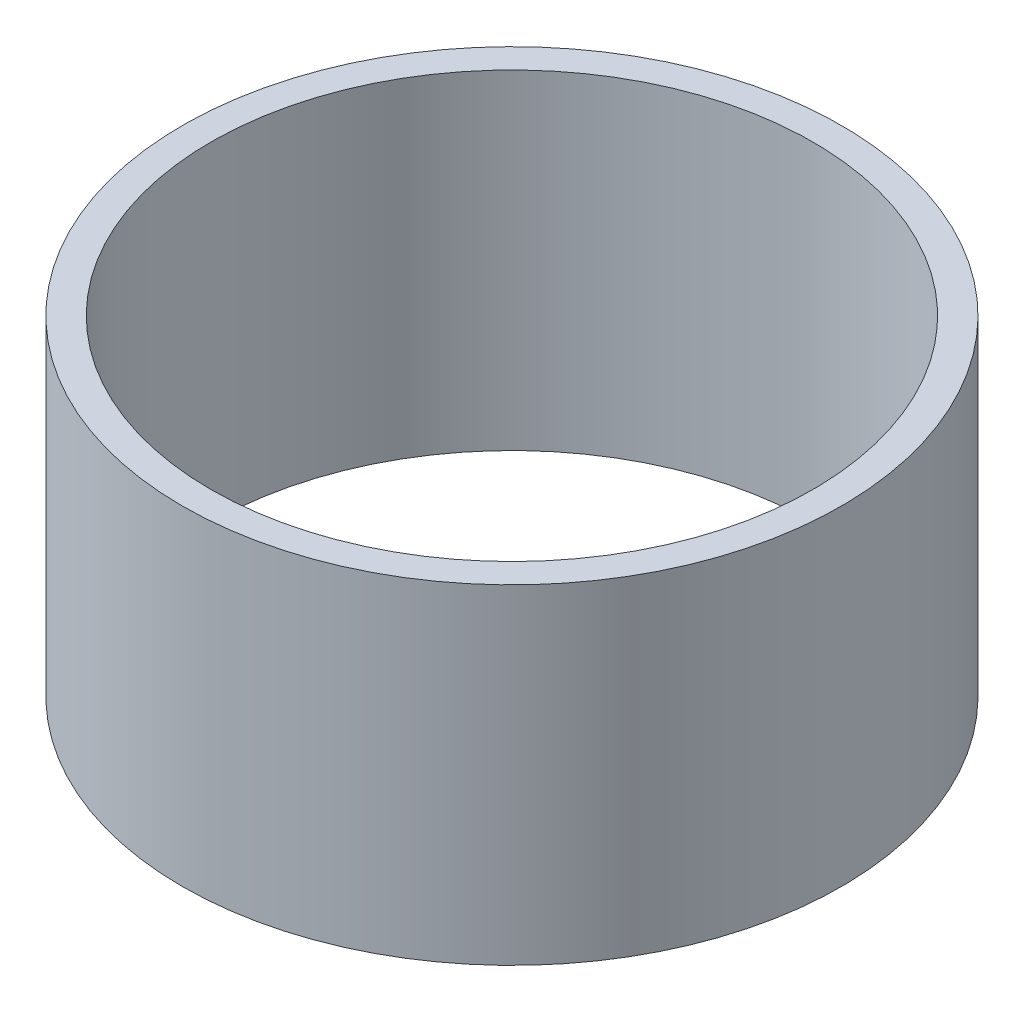
ISO-10303-21;
HEADER;
FILE_DESCRIPTION(('STEP AP214'),'2;1');
FILE_NAME('part.step','',(''),(''),'','','');
FILE_SCHEMA(('AUTOMOTIVE_DESIGN { 1 0 10303 214 1 1 1 1 }'));
ENDSEC;
DATA;
#1=APPLICATION_CONTEXT('core data for automotive mechanical design processes');
#2=APPLICATION_PROTOCOL_DEFINITION('international standard','automotive_design',2000,#1);
#3=PRODUCT_CONTEXT('',#1,'mechanical');
#4=PRODUCT('Part','Part','',(#3));
#5=PRODUCT_RELATED_PRODUCT_CATEGORY('part','',(#4));
#6=PRODUCT_DEFINITION_FORMATION('','',#4);
#7=PRODUCT_DEFINITION_CONTEXT('part definition',#1,'design');
#8=PRODUCT_DEFINITION('design','',#6,#7);
#9=PRODUCT_DEFINITION_SHAPE('','',#8);
#10=(LENGTH_UNIT() NAMED_UNIT(*) SI_UNIT(.MILLI.,.METRE.));
#11=(NAMED_UNIT(*) PLANE_ANGLE_UNIT() SI_UNIT($,.RADIAN.));
#12=(NAMED_UNIT(*) SI_UNIT($,.STERADIAN.) SOLID_ANGLE_UNIT());
#13=UNCERTAINTY_MEASURE_WITH_UNIT(LENGTH_MEASURE(1.E-05),#10,'distance_accuracy_value','');
#14=(GEOMETRIC_REPRESENTATION_CONTEXT(3) GLOBAL_UNCERTAINTY_ASSIGNED_CONTEXT((#13)) GLOBAL_UNIT_ASSIGNED_CONTEXT((#10,
#11,#12)) REPRESENTATION_CONTEXT('',''));
#15=CARTESIAN_POINT('',(0.,0.,0.));
#16=DIRECTION('',(0.,0.,1.));
#17=DIRECTION('',(1.,0.,0.));
#18=AXIS2_PLACEMENT_3D('',#15,#16,#17);
#19=CARTESIAN_POINT('',(0.,-9.525,0.));
#20=DIRECTION('',(0.,1.,0.));
#21=DIRECTION('',(0.,0.,1.));
#22=AXIS2_PLACEMENT_3D('',#19,#20,#21);
#23=CYLINDRICAL_SURFACE('',#22,19.05);
#24=CARTESIAN_POINT('',(0.,-9.525,0.));
#25=DIRECTION('',(0.,1.,0.));
#26=DIRECTION('',(0.,0.,1.));
#27=AXIS2_PLACEMENT_3D('',#24,#25,#26);
#28=CIRCLE('',#27,19.05);
#29=CARTESIAN_POINT('',(0.,-9.525,19.05));
#30=VERTEX_POINT('',#29);
#31=EDGE_CURVE('E10',#30,#30,#28,.T.);
#32=ORIENTED_EDGE('',*,*,#31,.T.);
#33=EDGE_LOOP('',(#32));
#34=FACE_BOUND('',#33,.T.);
#35=CARTESIAN_POINT('',(0.,9.525,0.));
#36=DIRECTION('',(0.,1.,0.));
#37=DIRECTION('',(0.,0.,1.));
#38=AXIS2_PLACEMENT_3D('',#35,#36,#37);
#39=CIRCLE('',#38,19.05);
#40=CARTESIAN_POINT('',(0.,9.525,19.05));
#41=VERTEX_POINT('',#40);
#42=EDGE_CURVE('E36',#41,#41,#39,.T.);
#43=ORIENTED_EDGE('',*,*,#42,.F.);
#44=EDGE_LOOP('',(#43));
#45=FACE_BOUND('',#44,.T.);
#46=ADVANCED_FACE('F30',(#34,#45),#23,.T.);
#47=CARTESIAN_POINT('',(0.,-9.525,0.));
#48=DIRECTION('',(0.,1.,0.));
#49=DIRECTION('',(0.,0.,1.));
#50=AXIS2_PLACEMENT_3D('',#47,#48,#49);
#51=PLANE('',#50);
#52=CARTESIAN_POINT('',(0.,-9.525,0.));
#53=DIRECTION('',(0.,1.,0.));
#54=DIRECTION('',(0.,0.,1.));
#55=AXIS2_PLACEMENT_3D('',#52,#53,#54);
#56=CIRCLE('',#55,17.399);
#57=CARTESIAN_POINT('',(0.,-9.525,17.399));
#58=VERTEX_POINT('',#57);
#59=EDGE_CURVE('E40',#58,#58,#56,.T.);
#60=ORIENTED_EDGE('',*,*,#59,.T.);
#61=EDGE_LOOP('',(#60));
#62=FACE_BOUND('',#61,.T.);
#63=ORIENTED_EDGE('',*,*,#31,.F.);
#64=EDGE_LOOP('',(#63));
#65=FACE_BOUND('',#64,.T.);
#66=ADVANCED_FACE('F54',(#62,#65),#51,.F.);
#67=CARTESIAN_POINT('',(0.,9.525,0.));
#68=DIRECTION('',(0.,1.,0.));
#69=DIRECTION('',(0.,0.,1.));
#70=AXIS2_PLACEMENT_3D('',#67,#68,#69);
#71=PLANE('',#70);
#72=CARTESIAN_POINT('',(0.,9.525,0.));
#73=DIRECTION('',(0.,1.,0.));
#74=DIRECTION('',(0.,0.,1.));
#75=AXIS2_PLACEMENT_3D('',#72,#73,#74);
#76=CIRCLE('',#75,17.399);
#77=CARTESIAN_POINT('',(0.,9.525,17.399));
#78=VERTEX_POINT('',#77);
#79=EDGE_CURVE('E44',#78,#78,#76,.T.);
#80=ORIENTED_EDGE('',*,*,#79,.F.);
#81=EDGE_LOOP('',(#80));
#82=FACE_BOUND('',#81,.T.);
#83=ORIENTED_EDGE('',*,*,#42,.T.);
#84=EDGE_LOOP('',(#83));
#85=FACE_BOUND('',#84,.T.);
#86=ADVANCED_FACE('F52',(#82,#85),#71,.T.);
#87=CARTESIAN_POINT('',(0.,-9.525,0.));
#88=DIRECTION('',(0.,1.,0.));
#89=DIRECTION('',(0.,0.,1.));
#90=AXIS2_PLACEMENT_3D('',#87,#88,#89);
#91=CYLINDRICAL_SURFACE('',#90,17.399);
#92=ORIENTED_EDGE('',*,*,#59,.F.);
#93=EDGE_LOOP('',(#92));
#94=FACE_BOUND('',#93,.T.);
#95=ORIENTED_EDGE('',*,*,#79,.T.);
#96=EDGE_LOOP('',(#95));
#97=FACE_BOUND('',#96,.T.);
#98=ADVANCED_FACE('F50',(#94,#97),#91,.F.);
#99=CLOSED_SHELL('',(#46,#66,#86,#98));
#100=MANIFOLD_SOLID_BREP('B2',#99);
#101=ADVANCED_BREP_SHAPE_REPRESENTATION('',(#18,#100),#14);
#102=SHAPE_DEFINITION_REPRESENTATION(#9,#101);
ENDSEC;
END-ISO-10303-21;
